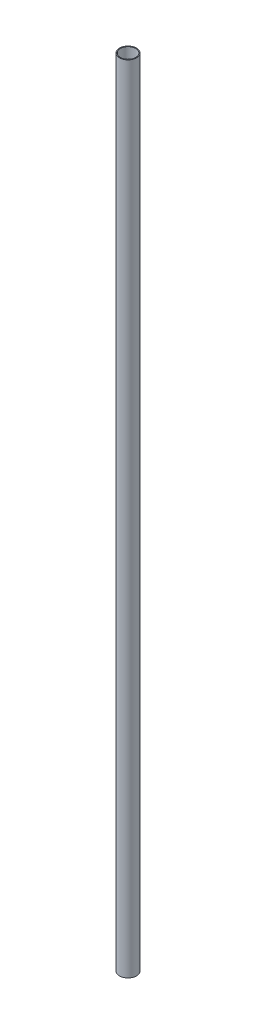
ISO-10303-21;
HEADER;
FILE_DESCRIPTION(('STEP AP214'),'2;1');
FILE_NAME('part.step','',(''),(''),'','','');
FILE_SCHEMA(('AUTOMOTIVE_DESIGN { 1 0 10303 214 1 1 1 1 }'));
ENDSEC;
DATA;
#1=APPLICATION_CONTEXT('core data for automotive mechanical design processes');
#2=APPLICATION_PROTOCOL_DEFINITION('international standard','automotive_design',2000,#1);
#3=PRODUCT_CONTEXT('',#1,'mechanical');
#4=PRODUCT('Part','Part','',(#3));
#5=PRODUCT_RELATED_PRODUCT_CATEGORY('part','',(#4));
#6=PRODUCT_DEFINITION_FORMATION('','',#4);
#7=PRODUCT_DEFINITION_CONTEXT('part definition',#1,'design');
#8=PRODUCT_DEFINITION('design','',#6,#7);
#9=PRODUCT_DEFINITION_SHAPE('','',#8);
#10=(LENGTH_UNIT() NAMED_UNIT(*) SI_UNIT(.MILLI.,.METRE.));
#11=(NAMED_UNIT(*) PLANE_ANGLE_UNIT() SI_UNIT($,.RADIAN.));
#12=(NAMED_UNIT(*) SI_UNIT($,.STERADIAN.) SOLID_ANGLE_UNIT());
#13=UNCERTAINTY_MEASURE_WITH_UNIT(LENGTH_MEASURE(1.E-05),#10,'distance_accuracy_value','');
#14=(GEOMETRIC_REPRESENTATION_CONTEXT(3) GLOBAL_UNCERTAINTY_ASSIGNED_CONTEXT((#13)) GLOBAL_UNIT_ASSIGNED_CONTEXT((#10,
#11,#12)) REPRESENTATION_CONTEXT('',''));
#15=CARTESIAN_POINT('',(0.,0.,0.));
#16=DIRECTION('',(0.,0.,1.));
#17=DIRECTION('',(1.,0.,0.));
#18=AXIS2_PLACEMENT_3D('',#15,#16,#17);
#19=CARTESIAN_POINT('',(0.,889.,0.));
#20=DIRECTION('',(0.,1.,0.));
#21=DIRECTION('',(0.,0.,1.));
#22=AXIS2_PLACEMENT_3D('',#19,#20,#21);
#23=PLANE('',#22);
#24=CARTESIAN_POINT('',(0.,889.,0.));
#25=DIRECTION('',(0.,1.,0.));
#26=DIRECTION('',(0.,0.,1.));
#27=AXIS2_PLACEMENT_3D('',#24,#25,#26);
#28=CIRCLE('',#27,9.525);
#29=CARTESIAN_POINT('',(0.,889.,9.525));
#30=VERTEX_POINT('',#29);
#31=EDGE_CURVE('E10',#30,#30,#28,.T.);
#32=ORIENTED_EDGE('',*,*,#31,.T.);
#33=EDGE_LOOP('',(#32));
#34=FACE_BOUND('',#33,.T.);
#35=CARTESIAN_POINT('',(0.,889.,0.));
#36=DIRECTION('',(0.,1.,0.));
#37=DIRECTION('',(0.,0.,1.));
#38=AXIS2_PLACEMENT_3D('',#35,#36,#37);
#39=CIRCLE('',#38,8.636);
#40=CARTESIAN_POINT('',(0.,889.,8.636));
#41=VERTEX_POINT('',#40);
#42=EDGE_CURVE('E42',#41,#41,#39,.T.);
#43=ORIENTED_EDGE('',*,*,#42,.F.);
#44=EDGE_LOOP('',(#43));
#45=FACE_BOUND('',#44,.T.);
#46=ADVANCED_FACE('F31',(#34,#45),#23,.T.);
#47=CARTESIAN_POINT('',(0.,0.,0.));
#48=DIRECTION('',(0.,1.,0.));
#49=DIRECTION('',(0.,0.,1.));
#50=AXIS2_PLACEMENT_3D('',#47,#48,#49);
#51=PLANE('',#50);
#52=CARTESIAN_POINT('',(0.,0.,0.));
#53=DIRECTION('',(0.,1.,0.));
#54=DIRECTION('',(0.,0.,1.));
#55=AXIS2_PLACEMENT_3D('',#52,#53,#54);
#56=CIRCLE('',#55,9.525);
#57=CARTESIAN_POINT('',(0.,0.,9.525));
#58=VERTEX_POINT('',#57);
#59=EDGE_CURVE('E35',#58,#58,#56,.T.);
#60=ORIENTED_EDGE('',*,*,#59,.F.);
#61=EDGE_LOOP('',(#60));
#62=FACE_BOUND('',#61,.T.);
#63=CARTESIAN_POINT('',(0.,0.,0.));
#64=DIRECTION('',(0.,1.,0.));
#65=DIRECTION('',(0.,0.,1.));
#66=AXIS2_PLACEMENT_3D('',#63,#64,#65);
#67=CIRCLE('',#66,8.636);
#68=CARTESIAN_POINT('',(0.,0.,8.636));
#69=VERTEX_POINT('',#68);
#70=EDGE_CURVE('E44',#69,#69,#67,.T.);
#71=ORIENTED_EDGE('',*,*,#70,.T.);
#72=EDGE_LOOP('',(#71));
#73=FACE_BOUND('',#72,.T.);
#74=ADVANCED_FACE('F54',(#62,#73),#51,.F.);
#75=CARTESIAN_POINT('',(0.,889.,0.));
#76=DIRECTION('',(0.,-1.,0.));
#77=DIRECTION('',(0.,0.,-1.));
#78=AXIS2_PLACEMENT_3D('',#75,#76,#77);
#79=CYLINDRICAL_SURFACE('',#78,9.525);
#80=ORIENTED_EDGE('',*,*,#31,.F.);
#81=EDGE_LOOP('',(#80));
#82=FACE_BOUND('',#81,.T.);
#83=ORIENTED_EDGE('',*,*,#59,.T.);
#84=EDGE_LOOP('',(#83));
#85=FACE_BOUND('',#84,.T.);
#86=ADVANCED_FACE('F33',(#82,#85),#79,.T.);
#87=CARTESIAN_POINT('',(0.,889.,0.));
#88=DIRECTION('',(0.,-1.,0.));
#89=DIRECTION('',(0.,0.,-1.));
#90=AXIS2_PLACEMENT_3D('',#87,#88,#89);
#91=CYLINDRICAL_SURFACE('',#90,8.636);
#92=ORIENTED_EDGE('',*,*,#42,.T.);
#93=EDGE_LOOP('',(#92));
#94=FACE_BOUND('',#93,.T.);
#95=ORIENTED_EDGE('',*,*,#70,.F.);
#96=EDGE_LOOP('',(#95));
#97=FACE_BOUND('',#96,.T.);
#98=ADVANCED_FACE('F50',(#94,#97),#91,.F.);
#99=CLOSED_SHELL('',(#46,#74,#86,#98));
#100=MANIFOLD_SOLID_BREP('B2',#99);
#101=ADVANCED_BREP_SHAPE_REPRESENTATION('',(#18,#100),#14);
#102=SHAPE_DEFINITION_REPRESENTATION(#9,#101);
ENDSEC;
END-ISO-10303-21;
